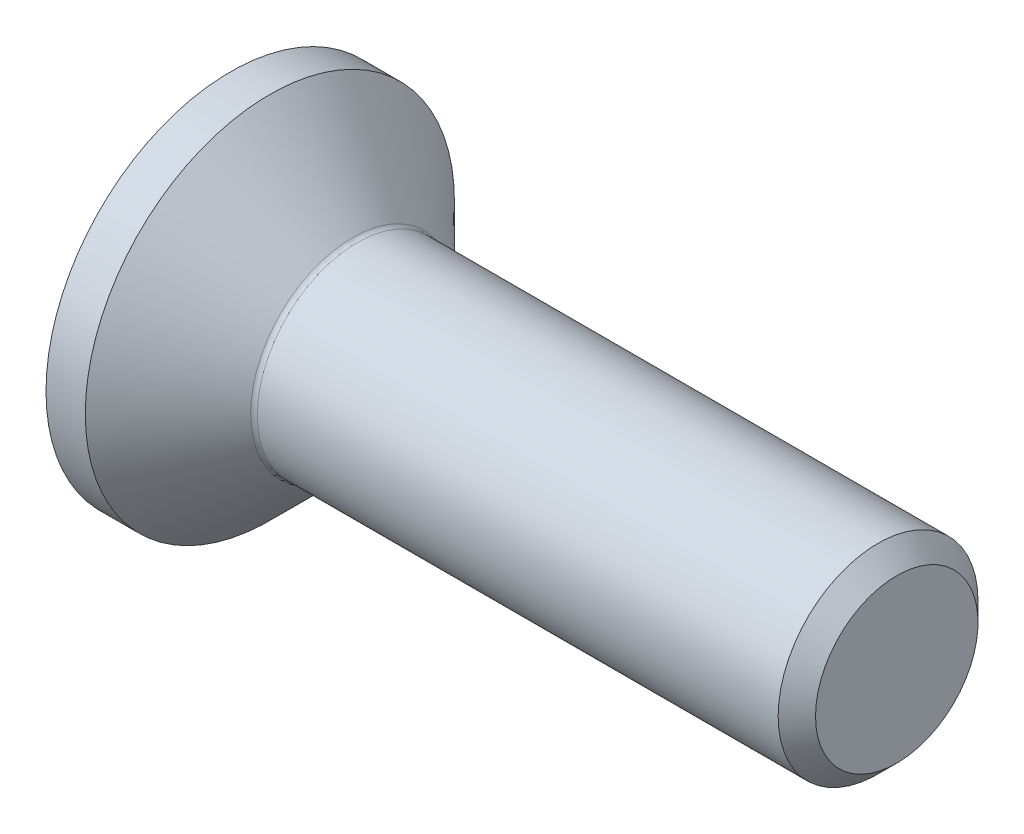
ISO-10303-21;
HEADER;
FILE_DESCRIPTION(('STEP AP214'),'2;1');
FILE_NAME('part.step','',(''),(''),'','','');
FILE_SCHEMA(('AUTOMOTIVE_DESIGN { 1 0 10303 214 1 1 1 1 }'));
ENDSEC;
DATA;
#1=APPLICATION_CONTEXT('core data for automotive mechanical design processes');
#2=APPLICATION_PROTOCOL_DEFINITION('international standard','automotive_design',2000,#1);
#3=PRODUCT_CONTEXT('',#1,'mechanical');
#4=PRODUCT('Part','Part','',(#3));
#5=PRODUCT_RELATED_PRODUCT_CATEGORY('part','',(#4));
#6=PRODUCT_DEFINITION_FORMATION('','',#4);
#7=PRODUCT_DEFINITION_CONTEXT('part definition',#1,'design');
#8=PRODUCT_DEFINITION('design','',#6,#7);
#9=PRODUCT_DEFINITION_SHAPE('','',#8);
#10=(LENGTH_UNIT() NAMED_UNIT(*) SI_UNIT(.MILLI.,.METRE.));
#11=(NAMED_UNIT(*) PLANE_ANGLE_UNIT() SI_UNIT($,.RADIAN.));
#12=(NAMED_UNIT(*) SI_UNIT($,.STERADIAN.) SOLID_ANGLE_UNIT());
#13=UNCERTAINTY_MEASURE_WITH_UNIT(LENGTH_MEASURE(1.E-05),#10,'distance_accuracy_value','');
#14=(GEOMETRIC_REPRESENTATION_CONTEXT(3) GLOBAL_UNCERTAINTY_ASSIGNED_CONTEXT((#13)) GLOBAL_UNIT_ASSIGNED_CONTEXT((#10,
#11,#12)) REPRESENTATION_CONTEXT('',''));
#15=CARTESIAN_POINT('',(0.,0.,0.));
#16=DIRECTION('',(0.,0.,1.));
#17=DIRECTION('',(1.,0.,0.));
#18=AXIS2_PLACEMENT_3D('',#15,#16,#17);
#19=CARTESIAN_POINT('',(0.,0.,0.));
#20=DIRECTION('',(-1.,0.,0.));
#21=DIRECTION('',(0.,0.,1.));
#22=AXIS2_PLACEMENT_3D('',#19,#20,#21);
#23=PLANE('',#22);
#24=CARTESIAN_POINT('',(0.,0.,0.));
#25=DIRECTION('',(-1.,0.,0.));
#26=DIRECTION('',(0.,0.,1.));
#27=AXIS2_PLACEMENT_3D('',#24,#25,#26);
#28=CIRCLE('',#27,2.77);
#29=CARTESIAN_POINT('',(0.,0.,2.77));
#30=VERTEX_POINT('',#29);
#31=EDGE_CURVE('E153',#30,#30,#28,.T.);
#32=ORIENTED_EDGE('',*,*,#31,.T.);
#33=EDGE_LOOP('',(#32));
#34=FACE_BOUND('',#33,.T.);
#35=DIRECTION('',(0.,-0.499999999999998,-0.86602540378444));
#36=VECTOR('',#35,1.);
#37=CARTESIAN_POINT('',(0.,-0.577350269189626,1.));
#38=LINE('',#37,#36);
#39=CARTESIAN_POINT('',(0.,-0.577350269189626,1.));
#40=VERTEX_POINT('',#39);
#41=CARTESIAN_POINT('',(0.,-1.15470053837925,0.));
#42=VERTEX_POINT('',#41);
#43=EDGE_CURVE('E119',#40,#42,#38,.T.);
#44=ORIENTED_EDGE('',*,*,#43,.T.);
#45=DIRECTION('',(0.,0.499999999999999,-0.866025403784439));
#46=VECTOR('',#45,1.);
#47=CARTESIAN_POINT('',(0.,-1.15470053837925,0.));
#48=LINE('',#47,#46);
#49=CARTESIAN_POINT('',(0.,-0.577350269189625,-1.));
#50=VERTEX_POINT('',#49);
#51=EDGE_CURVE('E50',#42,#50,#48,.T.);
#52=ORIENTED_EDGE('',*,*,#51,.T.);
#53=DIRECTION('',(0.,1.,0.));
#54=VECTOR('',#53,1.);
#55=CARTESIAN_POINT('',(0.,-0.577350269189625,-1.));
#56=LINE('',#55,#54);
#57=CARTESIAN_POINT('',(0.,0.577350269189626,-1.));
#58=VERTEX_POINT('',#57);
#59=EDGE_CURVE('E130',#50,#58,#56,.T.);
#60=ORIENTED_EDGE('',*,*,#59,.T.);
#61=DIRECTION('',(0.,0.5,0.866025403784439));
#62=VECTOR('',#61,1.);
#63=CARTESIAN_POINT('',(0.,0.577350269189626,-1.));
#64=LINE('',#63,#62);
#65=CARTESIAN_POINT('',(0.,1.15470053837925,0.));
#66=VERTEX_POINT('',#65);
#67=EDGE_CURVE('E254',#58,#66,#64,.T.);
#68=ORIENTED_EDGE('',*,*,#67,.T.);
#69=DIRECTION('',(0.,-0.499999999999999,0.866025403784439));
#70=VECTOR('',#69,1.);
#71=CARTESIAN_POINT('',(0.,1.15470053837925,0.));
#72=LINE('',#71,#70);
#73=CARTESIAN_POINT('',(0.,0.577350269189625,0.999999999999999));
#74=VERTEX_POINT('',#73);
#75=EDGE_CURVE('E257',#66,#74,#72,.T.);
#76=ORIENTED_EDGE('',*,*,#75,.T.);
#77=DIRECTION('',(0.,-1.,0.));
#78=VECTOR('',#77,1.);
#79=CARTESIAN_POINT('',(0.,0.577350269189625,0.999999999999999));
#80=LINE('',#79,#78);
#81=EDGE_CURVE('E260',#74,#40,#80,.T.);
#82=ORIENTED_EDGE('',*,*,#81,.T.);
#83=EDGE_LOOP('',(#44,#52,#60,#68,#76,#82));
#84=FACE_BOUND('',#83,.T.);
#85=ADVANCED_FACE('F35',(#34,#84),#23,.T.);
#86=CARTESIAN_POINT('',(0.,0.,0.));
#87=DIRECTION('',(-1.,0.,0.));
#88=DIRECTION('',(0.,0.,1.));
#89=AXIS2_PLACEMENT_3D('',#86,#87,#88);
#90=CYLINDRICAL_SURFACE('',#89,2.77);
#91=CARTESIAN_POINT('',(0.590000000000013,0.,0.));
#92=DIRECTION('',(-1.,0.,0.));
#93=DIRECTION('',(0.,0.,1.));
#94=AXIS2_PLACEMENT_3D('',#91,#92,#93);
#95=CIRCLE('',#94,2.77);
#96=CARTESIAN_POINT('',(0.590000000000013,0.,2.77));
#97=VERTEX_POINT('',#96);
#98=EDGE_CURVE('E150',#97,#97,#95,.T.);
#99=ORIENTED_EDGE('',*,*,#98,.T.);
#100=EDGE_LOOP('',(#99));
#101=FACE_BOUND('',#100,.T.);
#102=ORIENTED_EDGE('',*,*,#31,.F.);
#103=EDGE_LOOP('',(#102));
#104=FACE_BOUND('',#103,.T.);
#105=ADVANCED_FACE('F174',(#101,#104),#90,.T.);
#106=CARTESIAN_POINT('',(0.590000000000013,0.,0.));
#107=DIRECTION('',(-1.,0.,0.));
#108=DIRECTION('',(0.,0.,1.));
#109=AXIS2_PLACEMENT_3D('',#106,#107,#108);
#110=CONICAL_SURFACE('',#109,2.77,0.785398163397451);
#111=CARTESIAN_POINT('',(1.83071067811867,0.,0.));
#112=DIRECTION('',(-1.,0.,0.));
#113=DIRECTION('',(0.,0.,1.));
#114=AXIS2_PLACEMENT_3D('',#111,#112,#113);
#115=CIRCLE('',#114,1.52928932188133);
#116=CARTESIAN_POINT('',(1.83071067811867,0.,1.52928932188133));
#117=VERTEX_POINT('',#116);
#118=EDGE_CURVE('E43',#117,#117,#115,.T.);
#119=ORIENTED_EDGE('',*,*,#118,.T.);
#120=EDGE_LOOP('',(#119));
#121=FACE_BOUND('',#120,.T.);
#122=ORIENTED_EDGE('',*,*,#98,.F.);
#123=EDGE_LOOP('',(#122));
#124=FACE_BOUND('',#123,.T.);
#125=ADVANCED_FACE('F158',(#121,#124),#110,.T.);
#126=CARTESIAN_POINT('',(0.,0.,0.));
#127=DIRECTION('',(-1.,0.,0.));
#128=DIRECTION('',(0.,0.,1.));
#129=AXIS2_PLACEMENT_3D('',#126,#127,#128);
#130=CYLINDRICAL_SURFACE('',#129,1.49999999999999);
#131=CARTESIAN_POINT('',(1.90142135623733,0.,0.));
#132=DIRECTION('',(-1.,0.,0.));
#133=DIRECTION('',(0.,0.,1.));
#134=AXIS2_PLACEMENT_3D('',#131,#132,#133);
#135=CIRCLE('',#134,1.49999999999999);
#136=CARTESIAN_POINT('',(1.90142135623733,0.,1.49999999999999));
#137=VERTEX_POINT('',#136);
#138=EDGE_CURVE('E11',#137,#137,#135,.F.);
#139=ORIENTED_EDGE('',*,*,#138,.T.);
#140=EDGE_LOOP('',(#139));
#141=FACE_BOUND('',#140,.T.);
#142=CARTESIAN_POINT('',(9.71949999999998,0.,0.));
#143=DIRECTION('',(-1.,0.,0.));
#144=DIRECTION('',(0.,0.,1.));
#145=AXIS2_PLACEMENT_3D('',#142,#143,#144);
#146=CIRCLE('',#145,1.49999999999997);
#147=CARTESIAN_POINT('',(9.71949999999998,0.,1.49999999999997));
#148=VERTEX_POINT('',#147);
#149=EDGE_CURVE('E147',#148,#148,#146,.T.);
#150=ORIENTED_EDGE('',*,*,#149,.T.);
#151=EDGE_LOOP('',(#150));
#152=FACE_BOUND('',#151,.T.);
#153=ADVANCED_FACE('F185',(#141,#152),#130,.T.);
#154=CARTESIAN_POINT('',(10.,0.,0.));
#155=DIRECTION('',(-1.,0.,0.));
#156=DIRECTION('',(0.,0.,1.));
#157=AXIS2_PLACEMENT_3D('',#154,#155,#156);
#158=CONICAL_SURFACE('',#157,1.2195,0.785398163397365);
#159=ORIENTED_EDGE('',*,*,#149,.F.);
#160=EDGE_LOOP('',(#159));
#161=FACE_BOUND('',#160,.T.);
#162=CARTESIAN_POINT('',(10.,0.,0.));
#163=DIRECTION('',(-1.,0.,0.));
#164=DIRECTION('',(0.,0.,1.));
#165=AXIS2_PLACEMENT_3D('',#162,#163,#164);
#166=CIRCLE('',#165,1.2195);
#167=CARTESIAN_POINT('',(10.,0.,1.2195));
#168=VERTEX_POINT('',#167);
#169=EDGE_CURVE('E143',#168,#168,#166,.T.);
#170=ORIENTED_EDGE('',*,*,#169,.T.);
#171=EDGE_LOOP('',(#170));
#172=FACE_BOUND('',#171,.T.);
#173=ADVANCED_FACE('F169',(#161,#172),#158,.T.);
#174=CARTESIAN_POINT('',(10.,1.2195,0.));
#175=DIRECTION('',(1.,0.,0.));
#176=DIRECTION('',(0.,0.,-1.));
#177=AXIS2_PLACEMENT_3D('',#174,#175,#176);
#178=PLANE('',#177);
#179=ORIENTED_EDGE('',*,*,#169,.F.);
#180=EDGE_LOOP('',(#179));
#181=FACE_BOUND('',#180,.T.);
#182=ADVANCED_FACE('F162',(#181),#178,.T.);
#183=CARTESIAN_POINT('',(1.90142135623733,0.,0.));
#184=DIRECTION('',(-1.,0.,0.));
#185=DIRECTION('',(0.,0.,1.));
#186=AXIS2_PLACEMENT_3D('',#183,#184,#185);
#187=TOROIDAL_SURFACE('',#186,1.59999999999999,0.1);
#188=ORIENTED_EDGE('',*,*,#138,.F.);
#189=EDGE_LOOP('',(#188));
#190=FACE_BOUND('',#189,.T.);
#191=ORIENTED_EDGE('',*,*,#118,.F.);
#192=EDGE_LOOP('',(#191));
#193=FACE_BOUND('',#192,.T.);
#194=ADVANCED_FACE('F37',(#190,#193),#187,.F.);
#195=CARTESIAN_POINT('',(1.1,-1.15470053837925,0.));
#196=DIRECTION('',(0.,0.866025403784439,0.499999999999999));
#197=DIRECTION('',(0.,-0.499999999999999,0.866025403784439));
#198=AXIS2_PLACEMENT_3D('',#195,#196,#197);
#199=PLANE('',#198);
#200=ORIENTED_EDGE('',*,*,#51,.F.);
#201=DIRECTION('',(-1.,0.,0.));
#202=VECTOR('',#201,1.);
#203=CARTESIAN_POINT('',(1.1,-1.15470053837925,0.));
#204=LINE('',#203,#202);
#205=CARTESIAN_POINT('',(1.1,-1.15470053837925,0.));
#206=VERTEX_POINT('',#205);
#207=EDGE_CURVE('E251',#206,#42,#204,.T.);
#208=ORIENTED_EDGE('',*,*,#207,.F.);
#209=DIRECTION('',(0.,0.499999999999999,-0.866025403784439));
#210=VECTOR('',#209,1.);
#211=CARTESIAN_POINT('',(1.1,-1.15470053837925,0.));
#212=LINE('',#211,#210);
#213=CARTESIAN_POINT('',(1.1,-0.866025403784438,-0.499999999999998));
#214=VERTEX_POINT('',#213);
#215=EDGE_CURVE('E115',#206,#214,#212,.T.);
#216=ORIENTED_EDGE('',*,*,#215,.T.);
#217=CARTESIAN_POINT('',(1.1,-0.577350269189625,-1.));
#218=VERTEX_POINT('',#217);
#219=EDGE_CURVE('E111',#214,#218,#212,.T.);
#220=ORIENTED_EDGE('',*,*,#219,.T.);
#221=DIRECTION('',(-1.,0.,0.));
#222=VECTOR('',#221,1.);
#223=CARTESIAN_POINT('',(1.1,-0.577350269189625,-1.));
#224=LINE('',#223,#222);
#225=EDGE_CURVE('E113',#218,#50,#224,.T.);
#226=ORIENTED_EDGE('',*,*,#225,.T.);
#227=EDGE_LOOP('',(#200,#208,#216,#220,#226));
#228=FACE_BOUND('',#227,.T.);
#229=ADVANCED_FACE('F112',(#228),#199,.T.);
#230=CARTESIAN_POINT('',(1.1,-0.577350269189625,-1.));
#231=DIRECTION('',(0.,0.,1.));
#232=DIRECTION('',(1.,0.,0.));
#233=AXIS2_PLACEMENT_3D('',#230,#231,#232);
#234=PLANE('',#233);
#235=ORIENTED_EDGE('',*,*,#59,.F.);
#236=ORIENTED_EDGE('',*,*,#225,.F.);
#237=DIRECTION('',(0.,1.,0.));
#238=VECTOR('',#237,1.);
#239=CARTESIAN_POINT('',(1.1,-0.577350269189625,-1.));
#240=LINE('',#239,#238);
#241=CARTESIAN_POINT('',(1.1,0.,-1.));
#242=VERTEX_POINT('',#241);
#243=EDGE_CURVE('E58',#218,#242,#240,.T.);
#244=ORIENTED_EDGE('',*,*,#243,.T.);
#245=CARTESIAN_POINT('',(1.1,0.577350269189626,-1.));
#246=VERTEX_POINT('',#245);
#247=EDGE_CURVE('E125',#242,#246,#240,.T.);
#248=ORIENTED_EDGE('',*,*,#247,.T.);
#249=DIRECTION('',(-1.,0.,0.));
#250=VECTOR('',#249,1.);
#251=CARTESIAN_POINT('',(1.1,0.577350269189626,-1.));
#252=LINE('',#251,#250);
#253=EDGE_CURVE('E132',#246,#58,#252,.T.);
#254=ORIENTED_EDGE('',*,*,#253,.T.);
#255=EDGE_LOOP('',(#235,#236,#244,#248,#254));
#256=FACE_BOUND('',#255,.T.);
#257=ADVANCED_FACE('F127',(#256),#234,.T.);
#258=CARTESIAN_POINT('',(1.1,0.577350269189626,-1.));
#259=DIRECTION('',(0.,-0.866025403784438,0.5));
#260=DIRECTION('',(0.,-0.5,-0.866025403784439));
#261=AXIS2_PLACEMENT_3D('',#258,#259,#260);
#262=PLANE('',#261);
#263=ORIENTED_EDGE('',*,*,#67,.F.);
#264=ORIENTED_EDGE('',*,*,#253,.F.);
#265=DIRECTION('',(0.,0.5,0.866025403784439));
#266=VECTOR('',#265,1.);
#267=CARTESIAN_POINT('',(1.1,0.577350269189626,-1.));
#268=LINE('',#267,#266);
#269=CARTESIAN_POINT('',(1.1,0.866025403784439,-0.5));
#270=VERTEX_POINT('',#269);
#271=EDGE_CURVE('E232',#246,#270,#268,.T.);
#272=ORIENTED_EDGE('',*,*,#271,.T.);
#273=CARTESIAN_POINT('',(1.1,1.15470053837925,0.));
#274=VERTEX_POINT('',#273);
#275=EDGE_CURVE('E124',#270,#274,#268,.T.);
#276=ORIENTED_EDGE('',*,*,#275,.T.);
#277=DIRECTION('',(-1.,0.,0.));
#278=VECTOR('',#277,1.);
#279=CARTESIAN_POINT('',(1.1,1.15470053837925,0.));
#280=LINE('',#279,#278);
#281=EDGE_CURVE('E138',#274,#66,#280,.T.);
#282=ORIENTED_EDGE('',*,*,#281,.T.);
#283=EDGE_LOOP('',(#263,#264,#272,#276,#282));
#284=FACE_BOUND('',#283,.T.);
#285=ADVANCED_FACE('F199',(#284),#262,.T.);
#286=CARTESIAN_POINT('',(1.1,1.15470053837925,0.));
#287=DIRECTION('',(0.,-0.866025403784439,-0.499999999999999));
#288=DIRECTION('',(0.,0.499999999999999,-0.866025403784439));
#289=AXIS2_PLACEMENT_3D('',#286,#287,#288);
#290=PLANE('',#289);
#291=ORIENTED_EDGE('',*,*,#75,.F.);
#292=ORIENTED_EDGE('',*,*,#281,.F.);
#293=DIRECTION('',(0.,-0.499999999999999,0.866025403784439));
#294=VECTOR('',#293,1.);
#295=CARTESIAN_POINT('',(1.1,1.15470053837925,0.));
#296=LINE('',#295,#294);
#297=CARTESIAN_POINT('',(1.1,0.866025403784438,0.499999999999999));
#298=VERTEX_POINT('',#297);
#299=EDGE_CURVE('E239',#274,#298,#296,.T.);
#300=ORIENTED_EDGE('',*,*,#299,.T.);
#301=CARTESIAN_POINT('',(1.1,0.577350269189625,0.999999999999999));
#302=VERTEX_POINT('',#301);
#303=EDGE_CURVE('E237',#298,#302,#296,.T.);
#304=ORIENTED_EDGE('',*,*,#303,.T.);
#305=DIRECTION('',(-1.,0.,0.));
#306=VECTOR('',#305,1.);
#307=CARTESIAN_POINT('',(1.1,0.577350269189625,0.999999999999999));
#308=LINE('',#307,#306);
#309=EDGE_CURVE('E269',#302,#74,#308,.T.);
#310=ORIENTED_EDGE('',*,*,#309,.T.);
#311=EDGE_LOOP('',(#291,#292,#300,#304,#310));
#312=FACE_BOUND('',#311,.T.);
#313=ADVANCED_FACE('F202',(#312),#290,.T.);
#314=CARTESIAN_POINT('',(1.1,0.577350269189625,0.999999999999999));
#315=DIRECTION('',(0.,0.,-1.));
#316=DIRECTION('',(0.,1.,0.));
#317=AXIS2_PLACEMENT_3D('',#314,#315,#316);
#318=PLANE('',#317);
#319=ORIENTED_EDGE('',*,*,#81,.F.);
#320=ORIENTED_EDGE('',*,*,#309,.F.);
#321=DIRECTION('',(0.,-1.,0.));
#322=VECTOR('',#321,1.);
#323=CARTESIAN_POINT('',(1.1,0.577350269189625,0.999999999999999));
#324=LINE('',#323,#322);
#325=CARTESIAN_POINT('',(1.1,0.,1.));
#326=VERTEX_POINT('',#325);
#327=EDGE_CURVE('E244',#302,#326,#324,.T.);
#328=ORIENTED_EDGE('',*,*,#327,.T.);
#329=CARTESIAN_POINT('',(1.1,-0.577350269189626,1.));
#330=VERTEX_POINT('',#329);
#331=EDGE_CURVE('E243',#326,#330,#324,.T.);
#332=ORIENTED_EDGE('',*,*,#331,.T.);
#333=DIRECTION('',(-1.,0.,0.));
#334=VECTOR('',#333,1.);
#335=CARTESIAN_POINT('',(1.1,-0.577350269189626,1.));
#336=LINE('',#335,#334);
#337=EDGE_CURVE('E266',#330,#40,#336,.T.);
#338=ORIENTED_EDGE('',*,*,#337,.T.);
#339=EDGE_LOOP('',(#319,#320,#328,#332,#338));
#340=FACE_BOUND('',#339,.T.);
#341=ADVANCED_FACE('F206',(#340),#318,.T.);
#342=CARTESIAN_POINT('',(1.1,-0.577350269189626,1.));
#343=DIRECTION('',(0.,0.86602540378444,-0.499999999999998));
#344=DIRECTION('',(0.,0.499999999999998,0.86602540378444));
#345=AXIS2_PLACEMENT_3D('',#342,#343,#344);
#346=PLANE('',#345);
#347=ORIENTED_EDGE('',*,*,#43,.F.);
#348=ORIENTED_EDGE('',*,*,#337,.F.);
#349=DIRECTION('',(0.,-0.499999999999998,-0.86602540378444));
#350=VECTOR('',#349,1.);
#351=CARTESIAN_POINT('',(1.1,-0.577350269189626,1.));
#352=LINE('',#351,#350);
#353=CARTESIAN_POINT('',(1.1,-0.866025403784439,0.499999999999997));
#354=VERTEX_POINT('',#353);
#355=EDGE_CURVE('E248',#330,#354,#352,.T.);
#356=ORIENTED_EDGE('',*,*,#355,.T.);
#357=EDGE_CURVE('E247',#354,#206,#352,.T.);
#358=ORIENTED_EDGE('',*,*,#357,.T.);
#359=ORIENTED_EDGE('',*,*,#207,.T.);
#360=EDGE_LOOP('',(#347,#348,#356,#358,#359));
#361=FACE_BOUND('',#360,.T.);
#362=ADVANCED_FACE('F210',(#361),#346,.T.);
#363=CARTESIAN_POINT('',(1.1,-0.577350269189626,-1.));
#364=DIRECTION('',(1.,0.,0.));
#365=DIRECTION('',(0.,0.,-1.));
#366=AXIS2_PLACEMENT_3D('',#363,#364,#365);
#367=PLANE('',#366);
#368=ORIENTED_EDGE('',*,*,#243,.F.);
#369=ORIENTED_EDGE('',*,*,#219,.F.);
#370=CARTESIAN_POINT('',(1.1,0.,0.));
#371=DIRECTION('',(-1.,0.,0.));
#372=DIRECTION('',(0.,0.,1.));
#373=AXIS2_PLACEMENT_3D('',#370,#371,#372);
#374=CIRCLE('',#373,1.);
#375=EDGE_CURVE('E122',#242,#214,#374,.T.);
#376=ORIENTED_EDGE('',*,*,#375,.F.);
#377=EDGE_LOOP('',(#368,#369,#376));
#378=FACE_BOUND('',#377,.T.);
#379=ADVANCED_FACE('F121',(#378),#367,.F.);
#380=ORIENTED_EDGE('',*,*,#215,.F.);
#381=ORIENTED_EDGE('',*,*,#357,.F.);
#382=EDGE_CURVE('E135',#214,#354,#374,.T.);
#383=ORIENTED_EDGE('',*,*,#382,.F.);
#384=EDGE_LOOP('',(#380,#381,#383));
#385=FACE_BOUND('',#384,.T.);
#386=ADVANCED_FACE('F216',(#385),#367,.F.);
#387=ORIENTED_EDGE('',*,*,#355,.F.);
#388=ORIENTED_EDGE('',*,*,#331,.F.);
#389=EDGE_CURVE('E131',#354,#326,#374,.T.);
#390=ORIENTED_EDGE('',*,*,#389,.F.);
#391=EDGE_LOOP('',(#387,#388,#390));
#392=FACE_BOUND('',#391,.T.);
#393=ADVANCED_FACE('F220',(#392),#367,.F.);
#394=ORIENTED_EDGE('',*,*,#327,.F.);
#395=ORIENTED_EDGE('',*,*,#303,.F.);
#396=EDGE_CURVE('E137',#326,#298,#374,.T.);
#397=ORIENTED_EDGE('',*,*,#396,.F.);
#398=EDGE_LOOP('',(#394,#395,#397));
#399=FACE_BOUND('',#398,.T.);
#400=ADVANCED_FACE('F228',(#399),#367,.F.);
#401=ORIENTED_EDGE('',*,*,#299,.F.);
#402=ORIENTED_EDGE('',*,*,#275,.F.);
#403=EDGE_CURVE('E144',#298,#270,#374,.T.);
#404=ORIENTED_EDGE('',*,*,#403,.F.);
#405=EDGE_LOOP('',(#401,#402,#404));
#406=FACE_BOUND('',#405,.T.);
#407=ADVANCED_FACE('F223',(#406),#367,.F.);
#408=ORIENTED_EDGE('',*,*,#271,.F.);
#409=ORIENTED_EDGE('',*,*,#247,.F.);
#410=EDGE_CURVE('E233',#270,#242,#374,.T.);
#411=ORIENTED_EDGE('',*,*,#410,.F.);
#412=EDGE_LOOP('',(#408,#409,#411));
#413=FACE_BOUND('',#412,.T.);
#414=ADVANCED_FACE('F194',(#413),#367,.F.);
#415=CARTESIAN_POINT('',(1.1,0.,0.));
#416=DIRECTION('',(-1.,0.,0.));
#417=DIRECTION('',(0.,0.,1.));
#418=AXIS2_PLACEMENT_3D('',#415,#416,#417);
#419=CONICAL_SURFACE('',#418,1.,1.04719755119659);
#420=CARTESIAN_POINT('',(1.67735026918963,0.,0.));
#421=VERTEX_POINT('',#420);
#422=VERTEX_LOOP('',#421);
#423=FACE_BOUND('',#422,.T.);
#424=ORIENTED_EDGE('',*,*,#396,.T.);
#425=ORIENTED_EDGE('',*,*,#403,.T.);
#426=ORIENTED_EDGE('',*,*,#410,.T.);
#427=ORIENTED_EDGE('',*,*,#375,.T.);
#428=ORIENTED_EDGE('',*,*,#382,.T.);
#429=ORIENTED_EDGE('',*,*,#389,.T.);
#430=EDGE_LOOP('',(#424,#425,#426,#427,#428,#429));
#431=FACE_BOUND('',#430,.T.);
#432=ADVANCED_FACE('F192',(#423,#431),#419,.F.);
#433=CLOSED_SHELL('',(#85,#105,#125,#153,#173,#182,#194,#229,#257,#285,#313,#341,#362,#379,#386,
#393,#400,#407,#414,#432));
#434=MANIFOLD_SOLID_BREP('B2',#433);
#435=ADVANCED_BREP_SHAPE_REPRESENTATION('',(#18,#434),#14);
#436=SHAPE_DEFINITION_REPRESENTATION(#9,#435);
ENDSEC;
END-ISO-10303-21;
